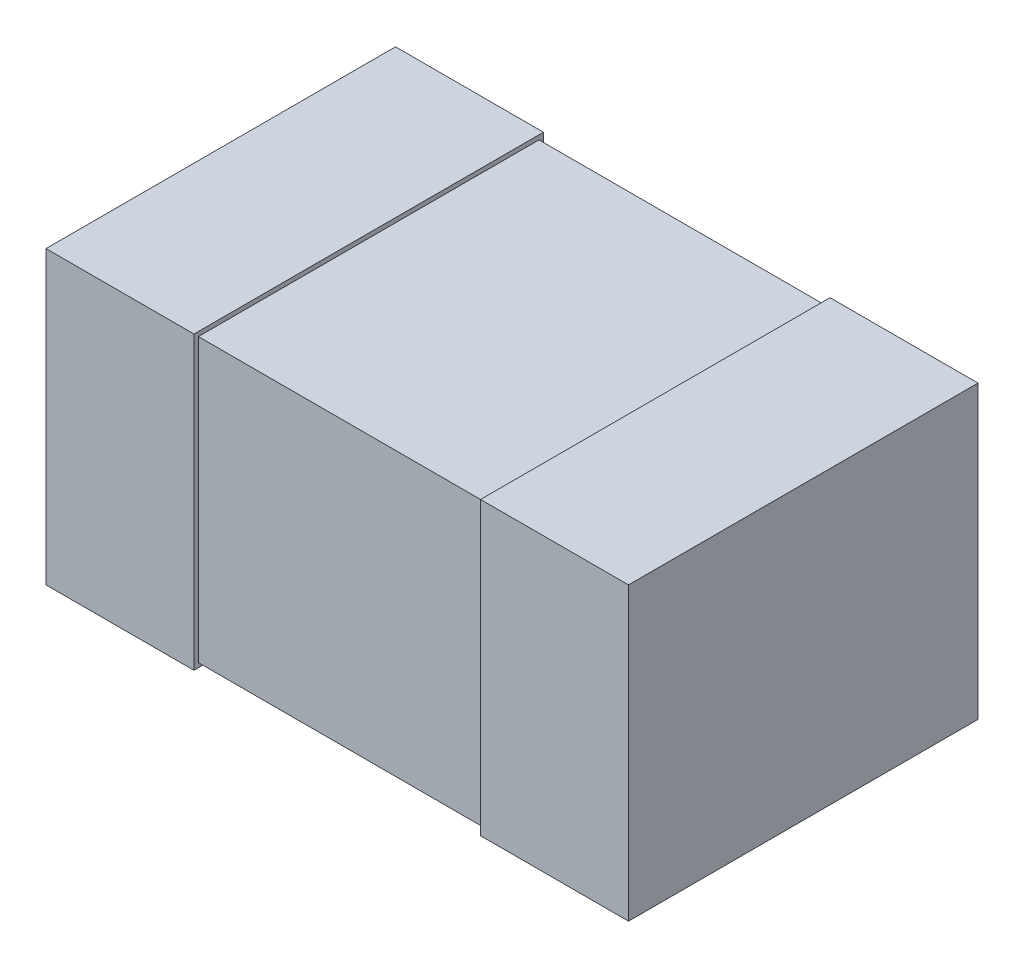
ISO-10303-21;
HEADER;
FILE_DESCRIPTION(('STEP AP214'),'2;1');
FILE_NAME('part.step','',(''),(''),'','','');
FILE_SCHEMA(('AUTOMOTIVE_DESIGN { 1 0 10303 214 1 1 1 1 }'));
ENDSEC;
DATA;
#1=APPLICATION_CONTEXT('core data for automotive mechanical design processes');
#2=APPLICATION_PROTOCOL_DEFINITION('international standard','automotive_design',2000,#1);
#3=PRODUCT_CONTEXT('',#1,'mechanical');
#4=PRODUCT('Part','Part','',(#3));
#5=PRODUCT_RELATED_PRODUCT_CATEGORY('part','',(#4));
#6=PRODUCT_DEFINITION_FORMATION('','',#4);
#7=PRODUCT_DEFINITION_CONTEXT('part definition',#1,'design');
#8=PRODUCT_DEFINITION('design','',#6,#7);
#9=PRODUCT_DEFINITION_SHAPE('','',#8);
#10=(LENGTH_UNIT() NAMED_UNIT(*) SI_UNIT(.MILLI.,.METRE.));
#11=(NAMED_UNIT(*) PLANE_ANGLE_UNIT() SI_UNIT($,.RADIAN.));
#12=(NAMED_UNIT(*) SI_UNIT($,.STERADIAN.) SOLID_ANGLE_UNIT());
#13=UNCERTAINTY_MEASURE_WITH_UNIT(LENGTH_MEASURE(1.E-05),#10,'distance_accuracy_value','');
#14=(GEOMETRIC_REPRESENTATION_CONTEXT(3) GLOBAL_UNCERTAINTY_ASSIGNED_CONTEXT((#13)) GLOBAL_UNIT_ASSIGNED_CONTEXT((#10,
#11,#12)) REPRESENTATION_CONTEXT('',''));
#15=CARTESIAN_POINT('',(0.,0.,0.));
#16=DIRECTION('',(0.,0.,1.));
#17=DIRECTION('',(1.,0.,0.));
#18=AXIS2_PLACEMENT_3D('',#15,#16,#17);
#19=CARTESIAN_POINT('',(0.5,-0.25,0.0762));
#20=DIRECTION('',(1.,0.,0.));
#21=DIRECTION('',(0.,1.,0.));
#22=AXIS2_PLACEMENT_3D('',#19,#20,#21);
#23=PLANE('',#22);
#24=DIRECTION('',(0.,1.,0.));
#25=VECTOR('',#24,1.);
#26=CARTESIAN_POINT('',(0.5,-0.25,0.0762));
#27=LINE('',#26,#25);
#28=CARTESIAN_POINT('',(0.5,-0.25,0.0762));
#29=VERTEX_POINT('',#28);
#30=CARTESIAN_POINT('',(0.5,0.25,0.0762));
#31=VERTEX_POINT('',#30);
#32=EDGE_CURVE('E147',#29,#31,#27,.T.);
#33=ORIENTED_EDGE('',*,*,#32,.T.);
#34=DIRECTION('',(0.,0.,1.));
#35=VECTOR('',#34,1.);
#36=CARTESIAN_POINT('',(0.5,0.25,0.0762));
#37=LINE('',#36,#35);
#38=CARTESIAN_POINT('',(0.5,0.25,0.6762));
#39=VERTEX_POINT('',#38);
#40=EDGE_CURVE('E145',#31,#39,#37,.T.);
#41=ORIENTED_EDGE('',*,*,#40,.T.);
#42=DIRECTION('',(0.,1.,0.));
#43=VECTOR('',#42,1.);
#44=CARTESIAN_POINT('',(0.5,-0.25,0.6762));
#45=LINE('',#44,#43);
#46=CARTESIAN_POINT('',(0.5,-0.25,0.6762));
#47=VERTEX_POINT('',#46);
#48=EDGE_CURVE('E135',#47,#39,#45,.T.);
#49=ORIENTED_EDGE('',*,*,#48,.F.);
#50=DIRECTION('',(0.,0.,1.));
#51=VECTOR('',#50,1.);
#52=CARTESIAN_POINT('',(0.5,-0.25,0.0762));
#53=LINE('',#52,#51);
#54=EDGE_CURVE('E11',#29,#47,#53,.T.);
#55=ORIENTED_EDGE('',*,*,#54,.F.);
#56=EDGE_LOOP('',(#33,#41,#49,#55));
#57=FACE_BOUND('',#56,.T.);
#58=ADVANCED_FACE('F17',(#57),#23,.T.);
#59=CARTESIAN_POINT('',(-0.5,0.25,0.0762));
#60=DIRECTION('',(-1.,0.,0.));
#61=DIRECTION('',(0.,0.,1.));
#62=AXIS2_PLACEMENT_3D('',#59,#60,#61);
#63=PLANE('',#62);
#64=DIRECTION('',(0.,-1.,0.));
#65=VECTOR('',#64,1.);
#66=CARTESIAN_POINT('',(-0.5,0.25,0.0762));
#67=LINE('',#66,#65);
#68=CARTESIAN_POINT('',(-0.5,0.25,0.0762));
#69=VERTEX_POINT('',#68);
#70=CARTESIAN_POINT('',(-0.5,-0.25,0.0762));
#71=VERTEX_POINT('',#70);
#72=EDGE_CURVE('E217',#69,#71,#67,.T.);
#73=ORIENTED_EDGE('',*,*,#72,.T.);
#74=DIRECTION('',(0.,0.,1.));
#75=VECTOR('',#74,1.);
#76=CARTESIAN_POINT('',(-0.5,-0.25,0.0762));
#77=LINE('',#76,#75);
#78=CARTESIAN_POINT('',(-0.5,-0.25,0.6762));
#79=VERTEX_POINT('',#78);
#80=EDGE_CURVE('E28',#71,#79,#77,.T.);
#81=ORIENTED_EDGE('',*,*,#80,.T.);
#82=DIRECTION('',(0.,-1.,0.));
#83=VECTOR('',#82,1.);
#84=CARTESIAN_POINT('',(-0.5,0.25,0.6762));
#85=LINE('',#84,#83);
#86=CARTESIAN_POINT('',(-0.5,0.25,0.6762));
#87=VERTEX_POINT('',#86);
#88=EDGE_CURVE('E152',#87,#79,#85,.T.);
#89=ORIENTED_EDGE('',*,*,#88,.F.);
#90=DIRECTION('',(0.,0.,1.));
#91=VECTOR('',#90,1.);
#92=CARTESIAN_POINT('',(-0.5,0.25,0.0762));
#93=LINE('',#92,#91);
#94=EDGE_CURVE('E164',#69,#87,#93,.T.);
#95=ORIENTED_EDGE('',*,*,#94,.F.);
#96=EDGE_LOOP('',(#73,#81,#89,#95));
#97=FACE_BOUND('',#96,.T.);
#98=ADVANCED_FACE('F475',(#97),#63,.T.);
#99=CARTESIAN_POINT('',(-0.5,-0.25,0.0762));
#100=DIRECTION('',(0.,-1.,0.));
#101=DIRECTION('',(0.,0.,-1.));
#102=AXIS2_PLACEMENT_3D('',#99,#100,#101);
#103=PLANE('',#102);
#104=DIRECTION('',(0.,0.,1.));
#105=VECTOR('',#104,1.);
#106=CARTESIAN_POINT('',(0.246,-0.25,0.0762));
#107=LINE('',#106,#105);
#108=CARTESIAN_POINT('',(0.246,-0.25,0.0762));
#109=VERTEX_POINT('',#108);
#110=CARTESIAN_POINT('',(0.246,-0.25,0.6762));
#111=VERTEX_POINT('',#110);
#112=EDGE_CURVE('E187',#109,#111,#107,.T.);
#113=ORIENTED_EDGE('',*,*,#112,.F.);
#114=DIRECTION('',(1.,0.,0.));
#115=VECTOR('',#114,1.);
#116=CARTESIAN_POINT('',(0.246,-0.25,0.0762));
#117=LINE('',#116,#115);
#118=EDGE_CURVE('E174',#109,#29,#117,.T.);
#119=ORIENTED_EDGE('',*,*,#118,.T.);
#120=ORIENTED_EDGE('',*,*,#54,.T.);
#121=DIRECTION('',(1.,0.,0.));
#122=VECTOR('',#121,1.);
#123=CARTESIAN_POINT('',(0.246,-0.25,0.6762));
#124=LINE('',#123,#122);
#125=EDGE_CURVE('E55',#111,#47,#124,.T.);
#126=ORIENTED_EDGE('',*,*,#125,.F.);
#127=EDGE_LOOP('',(#113,#119,#120,#126));
#128=FACE_BOUND('',#127,.T.);
#129=ADVANCED_FACE('F467',(#128),#103,.T.);
#130=CARTESIAN_POINT('',(-0.5,-0.25,0.0762));
#131=DIRECTION('',(0.,-1.,0.));
#132=DIRECTION('',(0.,0.,-1.));
#133=AXIS2_PLACEMENT_3D('',#130,#131,#132);
#134=PLANE('',#133);
#135=DIRECTION('',(0.,0.,1.));
#136=VECTOR('',#135,1.);
#137=CARTESIAN_POINT('',(-0.246,-0.25,0.0762));
#138=LINE('',#137,#136);
#139=CARTESIAN_POINT('',(-0.246,-0.25,0.0762));
#140=VERTEX_POINT('',#139);
#141=CARTESIAN_POINT('',(-0.246,-0.25,0.6762));
#142=VERTEX_POINT('',#141);
#143=EDGE_CURVE('E166',#140,#142,#138,.T.);
#144=ORIENTED_EDGE('',*,*,#143,.T.);
#145=DIRECTION('',(1.,0.,0.));
#146=VECTOR('',#145,1.);
#147=CARTESIAN_POINT('',(-0.5,-0.25,0.6762));
#148=LINE('',#147,#146);
#149=EDGE_CURVE('E195',#79,#142,#148,.T.);
#150=ORIENTED_EDGE('',*,*,#149,.F.);
#151=ORIENTED_EDGE('',*,*,#80,.F.);
#152=DIRECTION('',(1.,0.,0.));
#153=VECTOR('',#152,1.);
#154=CARTESIAN_POINT('',(-0.5,-0.25,0.0762));
#155=LINE('',#154,#153);
#156=EDGE_CURVE('E222',#71,#140,#155,.T.);
#157=ORIENTED_EDGE('',*,*,#156,.T.);
#158=EDGE_LOOP('',(#144,#150,#151,#157));
#159=FACE_BOUND('',#158,.T.);
#160=ADVANCED_FACE('F263',(#159),#134,.T.);
#161=CARTESIAN_POINT('',(0.,0.,0.6762));
#162=DIRECTION('',(0.,0.,1.));
#163=DIRECTION('',(1.,0.,0.));
#164=AXIS2_PLACEMENT_3D('',#161,#162,#163);
#165=PLANE('',#164);
#166=DIRECTION('',(0.,1.,0.));
#167=VECTOR('',#166,1.);
#168=CARTESIAN_POINT('',(0.246,-0.25,0.6762));
#169=LINE('',#168,#167);
#170=CARTESIAN_POINT('',(0.246,0.25,0.6762));
#171=VERTEX_POINT('',#170);
#172=EDGE_CURVE('E191',#111,#171,#169,.T.);
#173=ORIENTED_EDGE('',*,*,#172,.F.);
#174=ORIENTED_EDGE('',*,*,#125,.T.);
#175=ORIENTED_EDGE('',*,*,#48,.T.);
#176=DIRECTION('',(-1.,0.,0.));
#177=VECTOR('',#176,1.);
#178=CARTESIAN_POINT('',(0.5,0.25,0.6762));
#179=LINE('',#178,#177);
#180=EDGE_CURVE('E139',#39,#171,#179,.T.);
#181=ORIENTED_EDGE('',*,*,#180,.T.);
#182=EDGE_LOOP('',(#173,#174,#175,#181));
#183=FACE_BOUND('',#182,.T.);
#184=ADVANCED_FACE('F137',(#183),#165,.T.);
#185=CARTESIAN_POINT('',(0.,0.,0.6762));
#186=DIRECTION('',(0.,0.,1.));
#187=DIRECTION('',(1.,0.,0.));
#188=AXIS2_PLACEMENT_3D('',#185,#186,#187);
#189=PLANE('',#188);
#190=DIRECTION('',(0.,1.,0.));
#191=VECTOR('',#190,1.);
#192=CARTESIAN_POINT('',(-0.246,-0.25,0.6762));
#193=LINE('',#192,#191);
#194=CARTESIAN_POINT('',(-0.246,0.25,0.6762));
#195=VERTEX_POINT('',#194);
#196=EDGE_CURVE('E173',#142,#195,#193,.T.);
#197=ORIENTED_EDGE('',*,*,#196,.T.);
#198=DIRECTION('',(-1.,0.,0.));
#199=VECTOR('',#198,1.);
#200=CARTESIAN_POINT('',(-0.246,0.25,0.6762));
#201=LINE('',#200,#199);
#202=EDGE_CURVE('E21',#195,#87,#201,.T.);
#203=ORIENTED_EDGE('',*,*,#202,.T.);
#204=ORIENTED_EDGE('',*,*,#88,.T.);
#205=ORIENTED_EDGE('',*,*,#149,.T.);
#206=EDGE_LOOP('',(#197,#203,#204,#205));
#207=FACE_BOUND('',#206,.T.);
#208=ADVANCED_FACE('F442',(#207),#189,.T.);
#209=CARTESIAN_POINT('',(0.5,0.25,0.0762));
#210=DIRECTION('',(0.,1.,0.));
#211=DIRECTION('',(1.,0.,0.));
#212=AXIS2_PLACEMENT_3D('',#209,#210,#211);
#213=PLANE('',#212);
#214=DIRECTION('',(0.,0.,1.));
#215=VECTOR('',#214,1.);
#216=CARTESIAN_POINT('',(0.246,0.25,0.0762));
#217=LINE('',#216,#215);
#218=CARTESIAN_POINT('',(0.246,0.25,0.0762));
#219=VERTEX_POINT('',#218);
#220=EDGE_CURVE('E155',#219,#171,#217,.T.);
#221=ORIENTED_EDGE('',*,*,#220,.T.);
#222=ORIENTED_EDGE('',*,*,#180,.F.);
#223=ORIENTED_EDGE('',*,*,#40,.F.);
#224=DIRECTION('',(-1.,0.,0.));
#225=VECTOR('',#224,1.);
#226=CARTESIAN_POINT('',(0.5,0.25,0.0762));
#227=LINE('',#226,#225);
#228=EDGE_CURVE('E183',#31,#219,#227,.T.);
#229=ORIENTED_EDGE('',*,*,#228,.T.);
#230=EDGE_LOOP('',(#221,#222,#223,#229));
#231=FACE_BOUND('',#230,.T.);
#232=ADVANCED_FACE('F154',(#231),#213,.T.);
#233=CARTESIAN_POINT('',(0.5,0.25,0.0762));
#234=DIRECTION('',(0.,1.,0.));
#235=DIRECTION('',(1.,0.,0.));
#236=AXIS2_PLACEMENT_3D('',#233,#234,#235);
#237=PLANE('',#236);
#238=DIRECTION('',(0.,0.,1.));
#239=VECTOR('',#238,1.);
#240=CARTESIAN_POINT('',(-0.246,0.25,0.0762));
#241=LINE('',#240,#239);
#242=CARTESIAN_POINT('',(-0.246,0.25,0.0762));
#243=VERTEX_POINT('',#242);
#244=EDGE_CURVE('E169',#243,#195,#241,.T.);
#245=ORIENTED_EDGE('',*,*,#244,.F.);
#246=DIRECTION('',(-1.,0.,0.));
#247=VECTOR('',#246,1.);
#248=CARTESIAN_POINT('',(-0.246,0.25,0.0762));
#249=LINE('',#248,#247);
#250=EDGE_CURVE('E221',#243,#69,#249,.T.);
#251=ORIENTED_EDGE('',*,*,#250,.T.);
#252=ORIENTED_EDGE('',*,*,#94,.T.);
#253=ORIENTED_EDGE('',*,*,#202,.F.);
#254=EDGE_LOOP('',(#245,#251,#252,#253));
#255=FACE_BOUND('',#254,.T.);
#256=ADVANCED_FACE('F19',(#255),#237,.T.);
#257=CARTESIAN_POINT('',(0.246,-0.25,0.08382));
#258=DIRECTION('',(1.,0.,0.));
#259=DIRECTION('',(0.,1.,0.));
#260=AXIS2_PLACEMENT_3D('',#257,#258,#259);
#261=PLANE('',#260);
#262=DIRECTION('',(0.,1.,0.));
#263=VECTOR('',#262,1.);
#264=CARTESIAN_POINT('',(0.246,-0.24238,0.08382));
#265=LINE('',#264,#263);
#266=CARTESIAN_POINT('',(0.246,-0.24238,0.08382));
#267=VERTEX_POINT('',#266);
#268=CARTESIAN_POINT('',(0.246,0.24238,0.08382));
#269=VERTEX_POINT('',#268);
#270=EDGE_CURVE('E70',#267,#269,#265,.T.);
#271=ORIENTED_EDGE('',*,*,#270,.T.);
#272=DIRECTION('',(0.,0.,1.));
#273=VECTOR('',#272,1.);
#274=CARTESIAN_POINT('',(0.246,0.24238,0.08382));
#275=LINE('',#274,#273);
#276=CARTESIAN_POINT('',(0.246,0.24238,0.66858));
#277=VERTEX_POINT('',#276);
#278=EDGE_CURVE('E198',#269,#277,#275,.T.);
#279=ORIENTED_EDGE('',*,*,#278,.T.);
#280=DIRECTION('',(0.,-1.,0.));
#281=VECTOR('',#280,1.);
#282=CARTESIAN_POINT('',(0.246,0.24238,0.66858));
#283=LINE('',#282,#281);
#284=CARTESIAN_POINT('',(0.246,-0.24238,0.66858));
#285=VERTEX_POINT('',#284);
#286=EDGE_CURVE('E227',#277,#285,#283,.T.);
#287=ORIENTED_EDGE('',*,*,#286,.T.);
#288=DIRECTION('',(0.,0.,-1.));
#289=VECTOR('',#288,1.);
#290=CARTESIAN_POINT('',(0.246,-0.24238,0.66858));
#291=LINE('',#290,#289);
#292=EDGE_CURVE('E228',#285,#267,#291,.T.);
#293=ORIENTED_EDGE('',*,*,#292,.T.);
#294=EDGE_LOOP('',(#271,#279,#287,#293));
#295=FACE_BOUND('',#294,.T.);
#296=DIRECTION('',(0.,1.,0.));
#297=VECTOR('',#296,1.);
#298=CARTESIAN_POINT('',(0.246,-0.25,0.0762));
#299=LINE('',#298,#297);
#300=EDGE_CURVE('E186',#109,#219,#299,.T.);
#301=ORIENTED_EDGE('',*,*,#300,.F.);
#302=ORIENTED_EDGE('',*,*,#112,.T.);
#303=ORIENTED_EDGE('',*,*,#172,.T.);
#304=ORIENTED_EDGE('',*,*,#220,.F.);
#305=EDGE_LOOP('',(#301,#302,#303,#304));
#306=FACE_BOUND('',#305,.T.);
#307=ADVANCED_FACE('F419',(#295,#306),#261,.F.);
#308=CARTESIAN_POINT('',(-0.246,-0.25,0.08382));
#309=DIRECTION('',(0.,0.,1.));
#310=DIRECTION('',(1.,0.,0.));
#311=AXIS2_PLACEMENT_3D('',#308,#309,#310);
#312=PLANE('',#311);
#313=DIRECTION('',(1.,0.,0.));
#314=VECTOR('',#313,1.);
#315=CARTESIAN_POINT('',(-0.246,-0.24238,0.08382));
#316=LINE('',#315,#314);
#317=CARTESIAN_POINT('',(-0.246,-0.24238,0.08382));
#318=VERTEX_POINT('',#317);
#319=EDGE_CURVE('E213',#318,#267,#316,.T.);
#320=ORIENTED_EDGE('',*,*,#319,.F.);
#321=DIRECTION('',(0.,1.,0.));
#322=VECTOR('',#321,1.);
#323=CARTESIAN_POINT('',(-0.246,-0.24238,0.08382));
#324=LINE('',#323,#322);
#325=CARTESIAN_POINT('',(-0.246,0.24238,0.08382));
#326=VERTEX_POINT('',#325);
#327=EDGE_CURVE('E214',#318,#326,#324,.T.);
#328=ORIENTED_EDGE('',*,*,#327,.T.);
#329=DIRECTION('',(1.,0.,0.));
#330=VECTOR('',#329,1.);
#331=CARTESIAN_POINT('',(-0.246,0.24238,0.08382));
#332=LINE('',#331,#330);
#333=EDGE_CURVE('E243',#326,#269,#332,.T.);
#334=ORIENTED_EDGE('',*,*,#333,.T.);
#335=ORIENTED_EDGE('',*,*,#270,.F.);
#336=EDGE_LOOP('',(#320,#328,#334,#335));
#337=FACE_BOUND('',#336,.T.);
#338=ADVANCED_FACE('F424',(#337),#312,.F.);
#339=CARTESIAN_POINT('',(-0.246,0.24238,0.0762));
#340=DIRECTION('',(0.,-1.,0.));
#341=DIRECTION('',(0.,0.,-1.));
#342=AXIS2_PLACEMENT_3D('',#339,#340,#341);
#343=PLANE('',#342);
#344=ORIENTED_EDGE('',*,*,#333,.F.);
#345=DIRECTION('',(0.,0.,1.));
#346=VECTOR('',#345,1.);
#347=CARTESIAN_POINT('',(-0.246,0.24238,0.08382));
#348=LINE('',#347,#346);
#349=CARTESIAN_POINT('',(-0.246,0.24238,0.66858));
#350=VERTEX_POINT('',#349);
#351=EDGE_CURVE('E204',#326,#350,#348,.T.);
#352=ORIENTED_EDGE('',*,*,#351,.T.);
#353=DIRECTION('',(1.,0.,0.));
#354=VECTOR('',#353,1.);
#355=CARTESIAN_POINT('',(-0.246,0.24238,0.66858));
#356=LINE('',#355,#354);
#357=EDGE_CURVE('E223',#350,#277,#356,.T.);
#358=ORIENTED_EDGE('',*,*,#357,.T.);
#359=ORIENTED_EDGE('',*,*,#278,.F.);
#360=EDGE_LOOP('',(#344,#352,#358,#359));
#361=FACE_BOUND('',#360,.T.);
#362=ADVANCED_FACE('F498',(#361),#343,.F.);
#363=CARTESIAN_POINT('',(-0.246,0.25,0.66858));
#364=DIRECTION('',(0.,0.,-1.));
#365=DIRECTION('',(0.,-1.,0.));
#366=AXIS2_PLACEMENT_3D('',#363,#364,#365);
#367=PLANE('',#366);
#368=ORIENTED_EDGE('',*,*,#357,.F.);
#369=DIRECTION('',(0.,-1.,0.));
#370=VECTOR('',#369,1.);
#371=CARTESIAN_POINT('',(-0.246,0.24238,0.66858));
#372=LINE('',#371,#370);
#373=CARTESIAN_POINT('',(-0.246,-0.24238,0.66858));
#374=VERTEX_POINT('',#373);
#375=EDGE_CURVE('E182',#350,#374,#372,.T.);
#376=ORIENTED_EDGE('',*,*,#375,.T.);
#377=DIRECTION('',(1.,0.,0.));
#378=VECTOR('',#377,1.);
#379=CARTESIAN_POINT('',(-0.246,-0.24238,0.66858));
#380=LINE('',#379,#378);
#381=EDGE_CURVE('E209',#374,#285,#380,.T.);
#382=ORIENTED_EDGE('',*,*,#381,.T.);
#383=ORIENTED_EDGE('',*,*,#286,.F.);
#384=EDGE_LOOP('',(#368,#376,#382,#383));
#385=FACE_BOUND('',#384,.T.);
#386=ADVANCED_FACE('F505',(#385),#367,.F.);
#387=CARTESIAN_POINT('',(-0.246,-0.24238,0.6762));
#388=DIRECTION('',(0.,1.,0.));
#389=DIRECTION('',(1.,0.,0.));
#390=AXIS2_PLACEMENT_3D('',#387,#388,#389);
#391=PLANE('',#390);
#392=ORIENTED_EDGE('',*,*,#381,.F.);
#393=DIRECTION('',(0.,0.,-1.));
#394=VECTOR('',#393,1.);
#395=CARTESIAN_POINT('',(-0.246,-0.24238,0.66858));
#396=LINE('',#395,#394);
#397=EDGE_CURVE('E178',#374,#318,#396,.T.);
#398=ORIENTED_EDGE('',*,*,#397,.T.);
#399=ORIENTED_EDGE('',*,*,#319,.T.);
#400=ORIENTED_EDGE('',*,*,#292,.F.);
#401=EDGE_LOOP('',(#392,#398,#399,#400));
#402=FACE_BOUND('',#401,.T.);
#403=ADVANCED_FACE('F411',(#402),#391,.F.);
#404=CARTESIAN_POINT('',(-0.246,-0.25,0.0762));
#405=DIRECTION('',(-1.,0.,0.));
#406=DIRECTION('',(0.,0.,1.));
#407=AXIS2_PLACEMENT_3D('',#404,#405,#406);
#408=PLANE('',#407);
#409=ORIENTED_EDGE('',*,*,#397,.F.);
#410=ORIENTED_EDGE('',*,*,#375,.F.);
#411=ORIENTED_EDGE('',*,*,#351,.F.);
#412=ORIENTED_EDGE('',*,*,#327,.F.);
#413=EDGE_LOOP('',(#409,#410,#411,#412));
#414=FACE_BOUND('',#413,.T.);
#415=DIRECTION('',(0.,1.,0.));
#416=VECTOR('',#415,1.);
#417=CARTESIAN_POINT('',(-0.246,-0.25,0.0762));
#418=LINE('',#417,#416);
#419=EDGE_CURVE('E234',#140,#243,#418,.T.);
#420=ORIENTED_EDGE('',*,*,#419,.T.);
#421=ORIENTED_EDGE('',*,*,#244,.T.);
#422=ORIENTED_EDGE('',*,*,#196,.F.);
#423=ORIENTED_EDGE('',*,*,#143,.F.);
#424=EDGE_LOOP('',(#420,#421,#422,#423));
#425=FACE_BOUND('',#424,.T.);
#426=ADVANCED_FACE('F271',(#414,#425),#408,.F.);
#427=CARTESIAN_POINT('',(0.,0.,0.0762));
#428=DIRECTION('',(0.,0.,1.));
#429=DIRECTION('',(1.,0.,0.));
#430=AXIS2_PLACEMENT_3D('',#427,#428,#429);
#431=PLANE('',#430);
#432=ORIENTED_EDGE('',*,*,#300,.T.);
#433=ORIENTED_EDGE('',*,*,#228,.F.);
#434=ORIENTED_EDGE('',*,*,#32,.F.);
#435=ORIENTED_EDGE('',*,*,#118,.F.);
#436=EDGE_LOOP('',(#432,#433,#434,#435));
#437=FACE_BOUND('',#436,.T.);
#438=ADVANCED_FACE('F388',(#437),#431,.F.);
#439=CARTESIAN_POINT('',(0.,0.,0.0762));
#440=DIRECTION('',(0.,0.,1.));
#441=DIRECTION('',(1.,0.,0.));
#442=AXIS2_PLACEMENT_3D('',#439,#440,#441);
#443=PLANE('',#442);
#444=ORIENTED_EDGE('',*,*,#419,.F.);
#445=ORIENTED_EDGE('',*,*,#156,.F.);
#446=ORIENTED_EDGE('',*,*,#72,.F.);
#447=ORIENTED_EDGE('',*,*,#250,.F.);
#448=EDGE_LOOP('',(#444,#445,#446,#447));
#449=FACE_BOUND('',#448,.T.);
#450=ADVANCED_FACE('F269',(#449),#443,.F.);
#451=CLOSED_SHELL('',(#58,#98,#129,#160,#184,#208,#232,#256,#307,#338,#362,#386,#403,#426,#438,#450));
#452=MANIFOLD_SOLID_BREP('B1',#451);
#453=ADVANCED_BREP_SHAPE_REPRESENTATION('',(#18,#452),#14);
#454=SHAPE_DEFINITION_REPRESENTATION(#9,#453);
ENDSEC;
END-ISO-10303-21;
